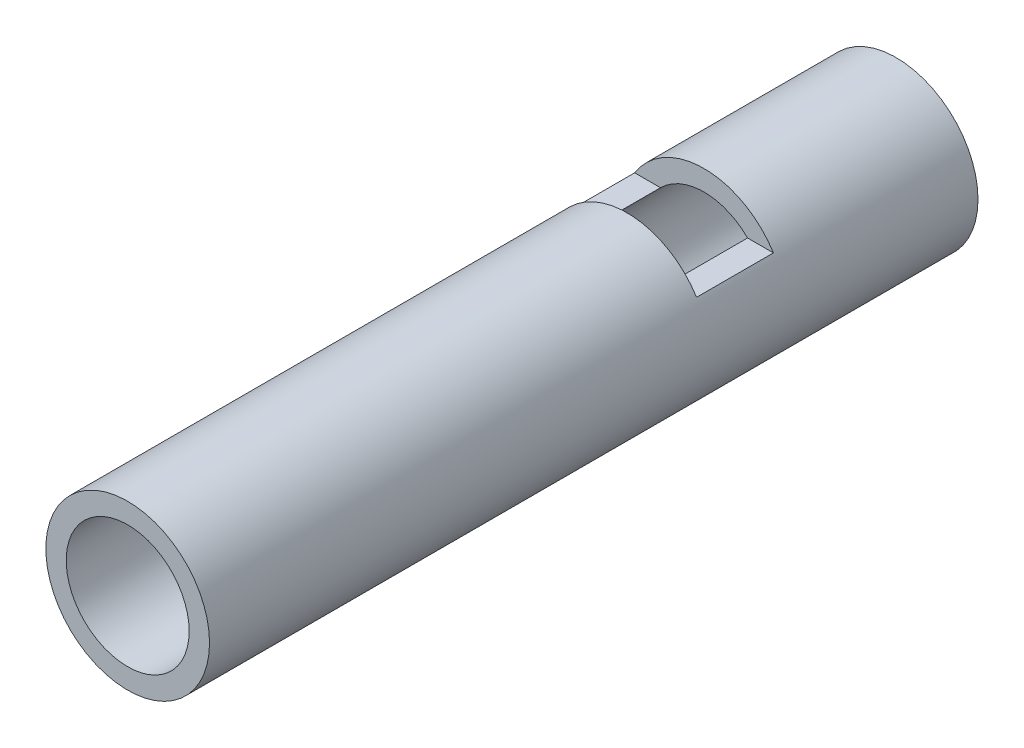
ISO-10303-21;
HEADER;
FILE_DESCRIPTION(('STEP AP214'),'2;1');
FILE_NAME('part.step','',(''),(''),'','','');
FILE_SCHEMA(('AUTOMOTIVE_DESIGN { 1 0 10303 214 1 1 1 1 }'));
ENDSEC;
DATA;
#1=APPLICATION_CONTEXT('core data for automotive mechanical design processes');
#2=APPLICATION_PROTOCOL_DEFINITION('international standard','automotive_design',2000,#1);
#3=PRODUCT_CONTEXT('',#1,'mechanical');
#4=PRODUCT('Part','Part','',(#3));
#5=PRODUCT_RELATED_PRODUCT_CATEGORY('part','',(#4));
#6=PRODUCT_DEFINITION_FORMATION('','',#4);
#7=PRODUCT_DEFINITION_CONTEXT('part definition',#1,'design');
#8=PRODUCT_DEFINITION('design','',#6,#7);
#9=PRODUCT_DEFINITION_SHAPE('','',#8);
#10=(LENGTH_UNIT() NAMED_UNIT(*) SI_UNIT(.MILLI.,.METRE.));
#11=(NAMED_UNIT(*) PLANE_ANGLE_UNIT() SI_UNIT($,.RADIAN.));
#12=(NAMED_UNIT(*) SI_UNIT($,.STERADIAN.) SOLID_ANGLE_UNIT());
#13=UNCERTAINTY_MEASURE_WITH_UNIT(LENGTH_MEASURE(1.E-05),#10,'distance_accuracy_value','');
#14=(GEOMETRIC_REPRESENTATION_CONTEXT(3) GLOBAL_UNCERTAINTY_ASSIGNED_CONTEXT((#13)) GLOBAL_UNIT_ASSIGNED_CONTEXT((#10,
#11,#12)) REPRESENTATION_CONTEXT('',''));
#15=CARTESIAN_POINT('',(0.,0.,0.));
#16=DIRECTION('',(0.,0.,1.));
#17=DIRECTION('',(1.,0.,0.));
#18=AXIS2_PLACEMENT_3D('',#15,#16,#17);
#19=CARTESIAN_POINT('',(0.,0.,100.));
#20=DIRECTION('',(0.,0.,-1.));
#21=DIRECTION('',(-1.,0.,0.));
#22=AXIS2_PLACEMENT_3D('',#19,#20,#21);
#23=CYLINDRICAL_SURFACE('',#22,10.65);
#24=CARTESIAN_POINT('',(0.,0.,100.));
#25=DIRECTION('',(0.,0.,1.));
#26=DIRECTION('',(1.,0.,0.));
#27=AXIS2_PLACEMENT_3D('',#24,#25,#26);
#28=CIRCLE('',#27,10.65);
#29=CARTESIAN_POINT('',(10.65,0.,100.));
#30=VERTEX_POINT('',#29);
#31=EDGE_CURVE('E108',#30,#30,#28,.T.);
#32=ORIENTED_EDGE('',*,*,#31,.F.);
#33=EDGE_LOOP('',(#32));
#34=FACE_BOUND('',#33,.T.);
#35=CARTESIAN_POINT('',(0.,0.,0.));
#36=DIRECTION('',(0.,0.,1.));
#37=DIRECTION('',(1.,0.,0.));
#38=AXIS2_PLACEMENT_3D('',#35,#36,#37);
#39=CIRCLE('',#38,10.65);
#40=CARTESIAN_POINT('',(10.65,0.,0.));
#41=VERTEX_POINT('',#40);
#42=EDGE_CURVE('E105',#41,#41,#39,.T.);
#43=ORIENTED_EDGE('',*,*,#42,.T.);
#44=EDGE_LOOP('',(#43));
#45=FACE_BOUND('',#44,.T.);
#46=CARTESIAN_POINT('',(0.,0.,25.));
#47=DIRECTION('',(0.,0.,1.));
#48=DIRECTION('',(0.,-1.,0.));
#49=AXIS2_PLACEMENT_3D('',#46,#47,#48);
#50=CIRCLE('',#49,10.65);
#51=CARTESIAN_POINT('',(9.0277350426341,5.64999999999967,25.));
#52=VERTEX_POINT('',#51);
#53=CARTESIAN_POINT('',(-9.0277350426341,5.64999999999967,25.));
#54=VERTEX_POINT('',#53);
#55=EDGE_CURVE('E91',#52,#54,#50,.T.);
#56=ORIENTED_EDGE('',*,*,#55,.F.);
#57=DIRECTION('',(0.,0.,-1.));
#58=VECTOR('',#57,1.);
#59=CARTESIAN_POINT('',(9.0277350426341,5.64999999999967,100.));
#60=LINE('',#59,#58);
#61=CARTESIAN_POINT('',(9.0277350426341,5.64999999999967,35.));
#62=VERTEX_POINT('',#61);
#63=EDGE_CURVE('E78',#62,#52,#60,.T.);
#64=ORIENTED_EDGE('',*,*,#63,.F.);
#65=CARTESIAN_POINT('',(0.,0.,35.));
#66=DIRECTION('',(0.,0.,-1.));
#67=DIRECTION('',(-1.,0.,0.));
#68=AXIS2_PLACEMENT_3D('',#65,#66,#67);
#69=CIRCLE('',#68,10.65);
#70=CARTESIAN_POINT('',(-9.0277350426341,5.64999999999967,35.));
#71=VERTEX_POINT('',#70);
#72=EDGE_CURVE('E88',#71,#62,#69,.T.);
#73=ORIENTED_EDGE('',*,*,#72,.F.);
#74=DIRECTION('',(0.,0.,-1.));
#75=VECTOR('',#74,1.);
#76=CARTESIAN_POINT('',(-9.0277350426341,5.64999999999967,100.));
#77=LINE('',#76,#75);
#78=EDGE_CURVE('E57',#54,#71,#77,.F.);
#79=ORIENTED_EDGE('',*,*,#78,.F.);
#80=EDGE_LOOP('',(#56,#64,#73,#79));
#81=FACE_BOUND('',#80,.T.);
#82=ADVANCED_FACE('F36',(#34,#45,#81),#23,.T.);
#83=CARTESIAN_POINT('',(0.,0.,100.));
#84=DIRECTION('',(0.,0.,-1.));
#85=DIRECTION('',(-1.,0.,0.));
#86=AXIS2_PLACEMENT_3D('',#83,#84,#85);
#87=CYLINDRICAL_SURFACE('',#86,8.);
#88=CARTESIAN_POINT('',(0.,0.,0.));
#89=DIRECTION('',(0.,0.,1.));
#90=DIRECTION('',(1.,0.,0.));
#91=AXIS2_PLACEMENT_3D('',#88,#89,#90);
#92=CIRCLE('',#91,8.);
#93=CARTESIAN_POINT('',(8.,0.,0.));
#94=VERTEX_POINT('',#93);
#95=EDGE_CURVE('E101',#94,#94,#92,.T.);
#96=ORIENTED_EDGE('',*,*,#95,.F.);
#97=EDGE_LOOP('',(#96));
#98=FACE_BOUND('',#97,.T.);
#99=CARTESIAN_POINT('',(0.,0.,100.));
#100=DIRECTION('',(0.,0.,1.));
#101=DIRECTION('',(1.,0.,0.));
#102=AXIS2_PLACEMENT_3D('',#99,#100,#101);
#103=CIRCLE('',#102,8.);
#104=CARTESIAN_POINT('',(8.,0.,100.));
#105=VERTEX_POINT('',#104);
#106=EDGE_CURVE('E102',#105,#105,#103,.T.);
#107=ORIENTED_EDGE('',*,*,#106,.T.);
#108=EDGE_LOOP('',(#107));
#109=FACE_BOUND('',#108,.T.);
#110=DIRECTION('',(0.,0.,-1.));
#111=VECTOR('',#110,1.);
#112=CARTESIAN_POINT('',(-5.66370020393062,5.64999999999967,100.));
#113=LINE('',#112,#111);
#114=CARTESIAN_POINT('',(-5.66370020393062,5.64999999999967,25.));
#115=VERTEX_POINT('',#114);
#116=CARTESIAN_POINT('',(-5.66370020393062,5.64999999999967,35.));
#117=VERTEX_POINT('',#116);
#118=EDGE_CURVE('E114',#115,#117,#113,.F.);
#119=ORIENTED_EDGE('',*,*,#118,.T.);
#120=CARTESIAN_POINT('',(0.,0.,35.));
#121=DIRECTION('',(0.,0.,-1.));
#122=DIRECTION('',(-1.,0.,0.));
#123=AXIS2_PLACEMENT_3D('',#120,#121,#122);
#124=CIRCLE('',#123,8.);
#125=CARTESIAN_POINT('',(5.66370020393062,5.64999999999967,35.));
#126=VERTEX_POINT('',#125);
#127=EDGE_CURVE('E11',#117,#126,#124,.T.);
#128=ORIENTED_EDGE('',*,*,#127,.T.);
#129=DIRECTION('',(0.,0.,-1.));
#130=VECTOR('',#129,1.);
#131=CARTESIAN_POINT('',(5.66370020393062,5.64999999999967,100.));
#132=LINE('',#131,#130);
#133=CARTESIAN_POINT('',(5.66370020393062,5.64999999999967,25.));
#134=VERTEX_POINT('',#133);
#135=EDGE_CURVE('E43',#126,#134,#132,.T.);
#136=ORIENTED_EDGE('',*,*,#135,.T.);
#137=CARTESIAN_POINT('',(0.,0.,25.));
#138=DIRECTION('',(0.,0.,1.));
#139=DIRECTION('',(0.,-1.,0.));
#140=AXIS2_PLACEMENT_3D('',#137,#138,#139);
#141=CIRCLE('',#140,8.);
#142=EDGE_CURVE('E93',#134,#115,#141,.T.);
#143=ORIENTED_EDGE('',*,*,#142,.T.);
#144=EDGE_LOOP('',(#119,#128,#136,#143));
#145=FACE_BOUND('',#144,.T.);
#146=ADVANCED_FACE('F117',(#98,#109,#145),#87,.F.);
#147=CARTESIAN_POINT('',(0.,0.,100.));
#148=DIRECTION('',(0.,0.,1.));
#149=DIRECTION('',(1.,0.,0.));
#150=AXIS2_PLACEMENT_3D('',#147,#148,#149);
#151=PLANE('',#150);
#152=ORIENTED_EDGE('',*,*,#31,.T.);
#153=EDGE_LOOP('',(#152));
#154=FACE_BOUND('',#153,.T.);
#155=ORIENTED_EDGE('',*,*,#106,.F.);
#156=EDGE_LOOP('',(#155));
#157=FACE_BOUND('',#156,.T.);
#158=ADVANCED_FACE('F134',(#154,#157),#151,.T.);
#159=CARTESIAN_POINT('',(0.,0.,0.));
#160=DIRECTION('',(0.,0.,1.));
#161=DIRECTION('',(1.,0.,0.));
#162=AXIS2_PLACEMENT_3D('',#159,#160,#161);
#163=PLANE('',#162);
#164=ORIENTED_EDGE('',*,*,#42,.F.);
#165=EDGE_LOOP('',(#164));
#166=FACE_BOUND('',#165,.T.);
#167=ORIENTED_EDGE('',*,*,#95,.T.);
#168=EDGE_LOOP('',(#167));
#169=FACE_BOUND('',#168,.T.);
#170=ADVANCED_FACE('F141',(#166,#169),#163,.F.);
#171=CARTESIAN_POINT('',(10.,10.6499999999997,35.));
#172=DIRECTION('',(0.,0.,-1.));
#173=DIRECTION('',(-1.,0.,0.));
#174=AXIS2_PLACEMENT_3D('',#171,#172,#173);
#175=PLANE('',#174);
#176=ORIENTED_EDGE('',*,*,#72,.T.);
#177=DIRECTION('',(-1.,0.,0.));
#178=VECTOR('',#177,1.);
#179=CARTESIAN_POINT('',(10.,5.64999999999967,35.));
#180=LINE('',#179,#178);
#181=EDGE_CURVE('E84',#62,#126,#180,.T.);
#182=ORIENTED_EDGE('',*,*,#181,.T.);
#183=ORIENTED_EDGE('',*,*,#127,.F.);
#184=EDGE_CURVE('E94',#117,#71,#180,.T.);
#185=ORIENTED_EDGE('',*,*,#184,.T.);
#186=EDGE_LOOP('',(#176,#182,#183,#185));
#187=FACE_BOUND('',#186,.T.);
#188=ADVANCED_FACE('F119',(#187),#175,.T.);
#189=CARTESIAN_POINT('',(10.,5.64999999999967,35.));
#190=DIRECTION('',(0.,1.,0.));
#191=DIRECTION('',(0.,0.,1.));
#192=AXIS2_PLACEMENT_3D('',#189,#190,#191);
#193=PLANE('',#192);
#194=ORIENTED_EDGE('',*,*,#63,.T.);
#195=DIRECTION('',(-1.,0.,0.));
#196=VECTOR('',#195,1.);
#197=CARTESIAN_POINT('',(10.,5.64999999999967,25.));
#198=LINE('',#197,#196);
#199=EDGE_CURVE('E81',#52,#134,#198,.T.);
#200=ORIENTED_EDGE('',*,*,#199,.T.);
#201=ORIENTED_EDGE('',*,*,#135,.F.);
#202=ORIENTED_EDGE('',*,*,#181,.F.);
#203=EDGE_LOOP('',(#194,#200,#201,#202));
#204=FACE_BOUND('',#203,.T.);
#205=ADVANCED_FACE('F80',(#204),#193,.T.);
#206=ORIENTED_EDGE('',*,*,#78,.T.);
#207=ORIENTED_EDGE('',*,*,#184,.F.);
#208=ORIENTED_EDGE('',*,*,#118,.F.);
#209=EDGE_CURVE('E50',#115,#54,#198,.T.);
#210=ORIENTED_EDGE('',*,*,#209,.T.);
#211=EDGE_LOOP('',(#206,#207,#208,#210));
#212=FACE_BOUND('',#211,.T.);
#213=ADVANCED_FACE('F120',(#212),#193,.T.);
#214=CARTESIAN_POINT('',(10.,10.6499999999997,25.));
#215=DIRECTION('',(0.,0.,1.));
#216=DIRECTION('',(0.,-1.,0.));
#217=AXIS2_PLACEMENT_3D('',#214,#215,#216);
#218=PLANE('',#217);
#219=ORIENTED_EDGE('',*,*,#55,.T.);
#220=ORIENTED_EDGE('',*,*,#209,.F.);
#221=ORIENTED_EDGE('',*,*,#142,.F.);
#222=ORIENTED_EDGE('',*,*,#199,.F.);
#223=EDGE_LOOP('',(#219,#220,#221,#222));
#224=FACE_BOUND('',#223,.T.);
#225=ADVANCED_FACE('F90',(#224),#218,.T.);
#226=CLOSED_SHELL('',(#82,#146,#158,#170,#188,#205,#213,#225));
#227=MANIFOLD_SOLID_BREP('B2',#226);
#228=ADVANCED_BREP_SHAPE_REPRESENTATION('',(#18,#227),#14);
#229=SHAPE_DEFINITION_REPRESENTATION(#9,#228);
ENDSEC;
END-ISO-10303-21;
